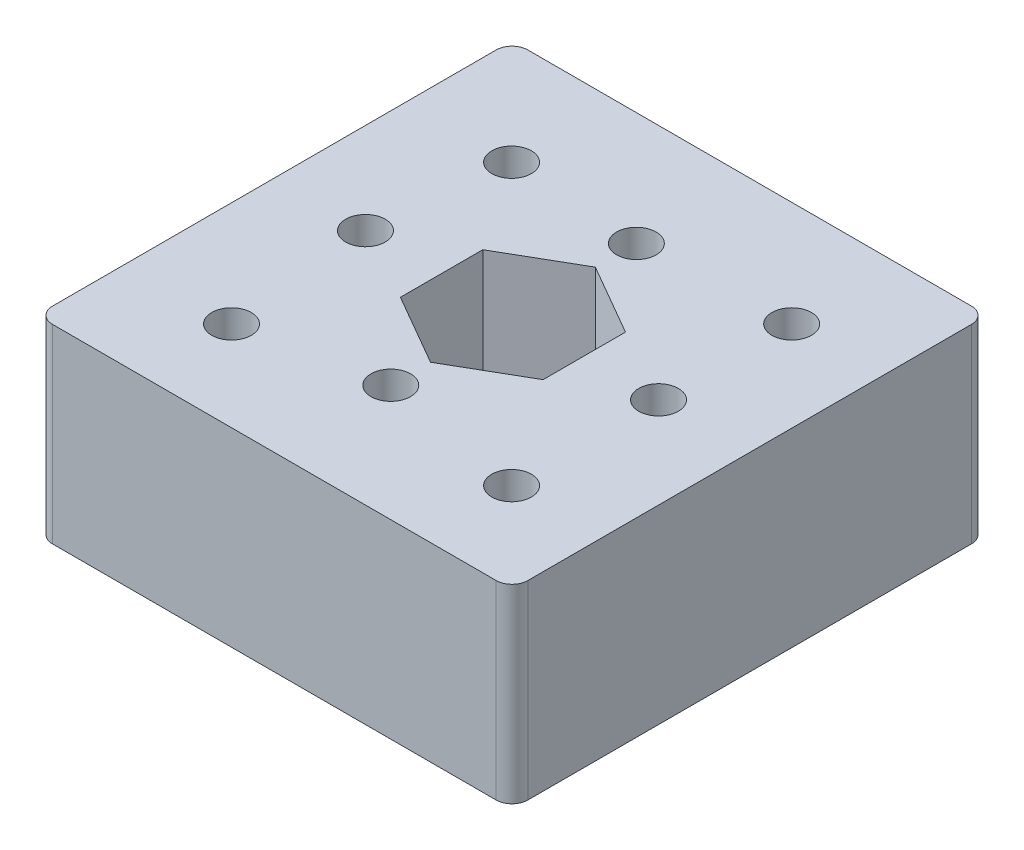
ISO-10303-21;
HEADER;
FILE_DESCRIPTION(('STEP AP214'),'2;1');
FILE_NAME('part.step','',(''),(''),'','','');
FILE_SCHEMA(('AUTOMOTIVE_DESIGN { 1 0 10303 214 1 1 1 1 }'));
ENDSEC;
DATA;
#1=APPLICATION_CONTEXT('core data for automotive mechanical design processes');
#2=APPLICATION_PROTOCOL_DEFINITION('international standard','automotive_design',2000,#1);
#3=PRODUCT_CONTEXT('',#1,'mechanical');
#4=PRODUCT('Part','Part','',(#3));
#5=PRODUCT_RELATED_PRODUCT_CATEGORY('part','',(#4));
#6=PRODUCT_DEFINITION_FORMATION('','',#4);
#7=PRODUCT_DEFINITION_CONTEXT('part definition',#1,'design');
#8=PRODUCT_DEFINITION('design','',#6,#7);
#9=PRODUCT_DEFINITION_SHAPE('','',#8);
#10=(LENGTH_UNIT() NAMED_UNIT(*) SI_UNIT(.MILLI.,.METRE.));
#11=(NAMED_UNIT(*) PLANE_ANGLE_UNIT() SI_UNIT($,.RADIAN.));
#12=(NAMED_UNIT(*) SI_UNIT($,.STERADIAN.) SOLID_ANGLE_UNIT());
#13=UNCERTAINTY_MEASURE_WITH_UNIT(LENGTH_MEASURE(1.E-05),#10,'distance_accuracy_value','');
#14=(GEOMETRIC_REPRESENTATION_CONTEXT(3) GLOBAL_UNCERTAINTY_ASSIGNED_CONTEXT((#13)) GLOBAL_UNIT_ASSIGNED_CONTEXT((#10,
#11,#12)) REPRESENTATION_CONTEXT('',''));
#15=CARTESIAN_POINT('',(0.,0.,0.));
#16=DIRECTION('',(0.,0.,1.));
#17=DIRECTION('',(1.,0.,0.));
#18=AXIS2_PLACEMENT_3D('',#15,#16,#17);
#19=CARTESIAN_POINT('',(0.,12.,0.));
#20=DIRECTION('',(0.,1.,0.));
#21=DIRECTION('',(0.,0.,1.));
#22=AXIS2_PLACEMENT_3D('',#19,#20,#21);
#23=PLANE('',#22);
#24=CARTESIAN_POINT('',(-8.37678757496881,12.,9.32640645963463));
#25=DIRECTION('',(0.,1.,0.));
#26=DIRECTION('',(0.,0.,1.));
#27=AXIS2_PLACEMENT_3D('',#24,#25,#26);
#28=CIRCLE('',#27,1.25);
#29=CARTESIAN_POINT('',(-8.37678757496881,12.,10.5764064596346));
#30=VERTEX_POINT('',#29);
#31=EDGE_CURVE('E651',#30,#30,#28,.T.);
#32=ORIENTED_EDGE('',*,*,#31,.F.);
#33=EDGE_LOOP('',(#32));
#34=FACE_BOUND('',#33,.T.);
#35=CARTESIAN_POINT('',(9.30088195469488,12.,-8.35126307002906));
#36=DIRECTION('',(0.,1.,0.));
#37=DIRECTION('',(0.,0.,1.));
#38=AXIS2_PLACEMENT_3D('',#35,#36,#37);
#39=CIRCLE('',#38,1.25);
#40=CARTESIAN_POINT('',(9.30088195469488,12.,-7.10126307002906));
#41=VERTEX_POINT('',#40);
#42=EDGE_CURVE('E663',#41,#41,#39,.T.);
#43=ORIENTED_EDGE('',*,*,#42,.F.);
#44=EDGE_LOOP('',(#43));
#45=FACE_BOUND('',#44,.T.);
#46=CARTESIAN_POINT('',(0.,12.,-7.84859131854548));
#47=DIRECTION('',(0.,1.,0.));
#48=DIRECTION('',(0.,0.,1.));
#49=AXIS2_PLACEMENT_3D('',#46,#47,#48);
#50=CIRCLE('',#49,1.25);
#51=CARTESIAN_POINT('',(0.,12.,-6.59859131854548));
#52=VERTEX_POINT('',#51);
#53=EDGE_CURVE('E675',#52,#52,#50,.T.);
#54=ORIENTED_EDGE('',*,*,#53,.F.);
#55=EDGE_LOOP('',(#54));
#56=FACE_BOUND('',#55,.T.);
#57=DIRECTION('',(0.,0.,-1.));
#58=VECTOR('',#57,1.);
#59=CARTESIAN_POINT('',(4.50333209967908,12.,2.54076447000943));
#60=LINE('',#59,#58);
#61=CARTESIAN_POINT('',(4.50333209967908,12.,2.54076447000943));
#62=VERTEX_POINT('',#61);
#63=CARTESIAN_POINT('',(4.50333209967908,12.,-2.65923552999057));
#64=VERTEX_POINT('',#63);
#65=EDGE_CURVE('E158',#62,#64,#60,.T.);
#66=ORIENTED_EDGE('',*,*,#65,.F.);
#67=DIRECTION('',(0.866025403784439,0.,-0.5));
#68=VECTOR('',#67,1.);
#69=CARTESIAN_POINT('',(0.,12.,5.14076447000943));
#70=LINE('',#69,#68);
#71=CARTESIAN_POINT('',(0.,12.,5.14076447000943));
#72=VERTEX_POINT('',#71);
#73=EDGE_CURVE('E147',#72,#62,#70,.T.);
#74=ORIENTED_EDGE('',*,*,#73,.F.);
#75=DIRECTION('',(0.866025403784439,0.,0.5));
#76=VECTOR('',#75,1.);
#77=CARTESIAN_POINT('',(-4.50333209967908,12.,2.54076447000943));
#78=LINE('',#77,#76);
#79=CARTESIAN_POINT('',(-4.50333209967908,12.,2.54076447000943));
#80=VERTEX_POINT('',#79);
#81=EDGE_CURVE('E187',#80,#72,#78,.T.);
#82=ORIENTED_EDGE('',*,*,#81,.F.);
#83=DIRECTION('',(0.,0.,1.));
#84=VECTOR('',#83,1.);
#85=CARTESIAN_POINT('',(-4.50333209967908,12.,-2.65923552999057));
#86=LINE('',#85,#84);
#87=CARTESIAN_POINT('',(-4.50333209967908,12.,-2.65923552999057));
#88=VERTEX_POINT('',#87);
#89=EDGE_CURVE('E183',#88,#80,#86,.T.);
#90=ORIENTED_EDGE('',*,*,#89,.F.);
#91=DIRECTION('',(-0.866025403784439,0.,0.5));
#92=VECTOR('',#91,1.);
#93=CARTESIAN_POINT('',(0.,12.,-5.25923552999057));
#94=LINE('',#93,#92);
#95=CARTESIAN_POINT('',(0.,12.,-5.25923552999057));
#96=VERTEX_POINT('',#95);
#97=EDGE_CURVE('E177',#96,#88,#94,.T.);
#98=ORIENTED_EDGE('',*,*,#97,.F.);
#99=DIRECTION('',(-0.866025403784439,0.,-0.5));
#100=VECTOR('',#99,1.);
#101=CARTESIAN_POINT('',(4.50333209967908,12.,-2.65923552999057));
#102=LINE('',#101,#100);
#103=EDGE_CURVE('E173',#64,#96,#102,.T.);
#104=ORIENTED_EDGE('',*,*,#103,.F.);
#105=EDGE_LOOP('',(#66,#74,#82,#90,#98,#104));
#106=FACE_BOUND('',#105,.T.);
#107=CARTESIAN_POINT('',(-9.25,12.,0.));
#108=DIRECTION('',(0.,1.,0.));
#109=DIRECTION('',(0.,0.,1.));
#110=AXIS2_PLACEMENT_3D('',#107,#108,#109);
#111=CIRCLE('',#110,1.25);
#112=CARTESIAN_POINT('',(-9.25,12.,1.25));
#113=VERTEX_POINT('',#112);
#114=EDGE_CURVE('E224',#113,#113,#111,.T.);
#115=ORIENTED_EDGE('',*,*,#114,.F.);
#116=EDGE_LOOP('',(#115));
#117=FACE_BOUND('',#116,.T.);
#118=DIRECTION('',(-1.,0.,0.));
#119=VECTOR('',#118,1.);
#120=CARTESIAN_POINT('',(-15.,12.,-15.));
#121=LINE('',#120,#119);
#122=CARTESIAN_POINT('',(14.,12.,-15.));
#123=VERTEX_POINT('',#122);
#124=CARTESIAN_POINT('',(-14.,12.,-15.));
#125=VERTEX_POINT('',#124);
#126=EDGE_CURVE('E236',#123,#125,#121,.T.);
#127=ORIENTED_EDGE('',*,*,#126,.T.);
#128=CARTESIAN_POINT('',(-14.,12.,-14.));
#129=DIRECTION('',(0.,1.,0.));
#130=DIRECTION('',(0.,0.,1.));
#131=AXIS2_PLACEMENT_3D('',#128,#129,#130);
#132=CIRCLE('',#131,1.);
#133=CARTESIAN_POINT('',(-15.,12.,-14.));
#134=VERTEX_POINT('',#133);
#135=EDGE_CURVE('E294',#125,#134,#132,.T.);
#136=ORIENTED_EDGE('',*,*,#135,.T.);
#137=DIRECTION('',(0.,0.,1.));
#138=VECTOR('',#137,1.);
#139=CARTESIAN_POINT('',(-15.,12.,-15.));
#140=LINE('',#139,#138);
#141=CARTESIAN_POINT('',(-15.,12.,14.));
#142=VERTEX_POINT('',#141);
#143=EDGE_CURVE('E241',#134,#142,#140,.T.);
#144=ORIENTED_EDGE('',*,*,#143,.T.);
#145=CARTESIAN_POINT('',(-14.,12.,14.));
#146=DIRECTION('',(0.,1.,0.));
#147=DIRECTION('',(0.,0.,1.));
#148=AXIS2_PLACEMENT_3D('',#145,#146,#147);
#149=CIRCLE('',#148,1.);
#150=CARTESIAN_POINT('',(-14.,12.,15.));
#151=VERTEX_POINT('',#150);
#152=EDGE_CURVE('E66',#142,#151,#149,.T.);
#153=ORIENTED_EDGE('',*,*,#152,.T.);
#154=DIRECTION('',(1.,0.,0.));
#155=VECTOR('',#154,1.);
#156=CARTESIAN_POINT('',(-15.,12.,15.));
#157=LINE('',#156,#155);
#158=CARTESIAN_POINT('',(14.,12.,15.));
#159=VERTEX_POINT('',#158);
#160=EDGE_CURVE('E244',#151,#159,#157,.T.);
#161=ORIENTED_EDGE('',*,*,#160,.T.);
#162=CARTESIAN_POINT('',(14.,12.,14.));
#163=DIRECTION('',(0.,1.,0.));
#164=DIRECTION('',(0.,0.,1.));
#165=AXIS2_PLACEMENT_3D('',#162,#163,#164);
#166=CIRCLE('',#165,1.);
#167=CARTESIAN_POINT('',(15.,12.,14.));
#168=VERTEX_POINT('',#167);
#169=EDGE_CURVE('E286',#159,#168,#166,.T.);
#170=ORIENTED_EDGE('',*,*,#169,.T.);
#171=DIRECTION('',(0.,0.,-1.));
#172=VECTOR('',#171,1.);
#173=CARTESIAN_POINT('',(15.,12.,-15.));
#174=LINE('',#173,#172);
#175=CARTESIAN_POINT('',(15.,12.,-14.));
#176=VERTEX_POINT('',#175);
#177=EDGE_CURVE('E232',#168,#176,#174,.T.);
#178=ORIENTED_EDGE('',*,*,#177,.T.);
#179=CARTESIAN_POINT('',(14.,12.,-14.));
#180=DIRECTION('',(0.,1.,0.));
#181=DIRECTION('',(0.,0.,1.));
#182=AXIS2_PLACEMENT_3D('',#179,#180,#181);
#183=CIRCLE('',#182,1.);
#184=EDGE_CURVE('E289',#176,#123,#183,.T.);
#185=ORIENTED_EDGE('',*,*,#184,.T.);
#186=EDGE_LOOP('',(#127,#136,#144,#153,#161,#170,#178,#185));
#187=FACE_BOUND('',#186,.T.);
#188=CARTESIAN_POINT('',(9.25,12.,0.));
#189=DIRECTION('',(0.,1.,0.));
#190=DIRECTION('',(0.,0.,1.));
#191=AXIS2_PLACEMENT_3D('',#188,#189,#190);
#192=CIRCLE('',#191,1.25);
#193=CARTESIAN_POINT('',(9.25,12.,1.25));
#194=VERTEX_POINT('',#193);
#195=EDGE_CURVE('E193',#194,#194,#192,.T.);
#196=ORIENTED_EDGE('',*,*,#195,.F.);
#197=EDGE_LOOP('',(#196));
#198=FACE_BOUND('',#197,.T.);
#199=CARTESIAN_POINT('',(0.,12.,7.65140868145452));
#200=DIRECTION('',(0.,1.,0.));
#201=DIRECTION('',(0.,0.,1.));
#202=AXIS2_PLACEMENT_3D('',#199,#200,#201);
#203=CIRCLE('',#202,1.25);
#204=CARTESIAN_POINT('',(0.,12.,8.90140868145452));
#205=VERTEX_POINT('',#204);
#206=EDGE_CURVE('E669',#205,#205,#203,.T.);
#207=ORIENTED_EDGE('',*,*,#206,.F.);
#208=EDGE_LOOP('',(#207));
#209=FACE_BOUND('',#208,.T.);
#210=CARTESIAN_POINT('',(9.30088195469488,12.,9.32640645963463));
#211=DIRECTION('',(0.,1.,0.));
#212=DIRECTION('',(0.,0.,1.));
#213=AXIS2_PLACEMENT_3D('',#210,#211,#212);
#214=CIRCLE('',#213,1.25);
#215=CARTESIAN_POINT('',(9.30088195469488,12.,10.5764064596346));
#216=VERTEX_POINT('',#215);
#217=EDGE_CURVE('E657',#216,#216,#214,.T.);
#218=ORIENTED_EDGE('',*,*,#217,.F.);
#219=EDGE_LOOP('',(#218));
#220=FACE_BOUND('',#219,.T.);
#221=CARTESIAN_POINT('',(-8.37678757496881,12.,-8.35126307002906));
#222=DIRECTION('',(0.,1.,0.));
#223=DIRECTION('',(0.,0.,1.));
#224=AXIS2_PLACEMENT_3D('',#221,#222,#223);
#225=CIRCLE('',#224,1.25);
#226=CARTESIAN_POINT('',(-8.37678757496881,12.,-7.10126307002906));
#227=VERTEX_POINT('',#226);
#228=EDGE_CURVE('E645',#227,#227,#225,.T.);
#229=ORIENTED_EDGE('',*,*,#228,.F.);
#230=EDGE_LOOP('',(#229));
#231=FACE_BOUND('',#230,.T.);
#232=ADVANCED_FACE('F43',(#34,#45,#56,#106,#117,#187,#198,#209,#220,#231),#23,.T.);
#233=CARTESIAN_POINT('',(0.,0.,0.));
#234=DIRECTION('',(0.,1.,0.));
#235=DIRECTION('',(0.,0.,1.));
#236=AXIS2_PLACEMENT_3D('',#233,#234,#235);
#237=PLANE('',#236);
#238=CARTESIAN_POINT('',(-9.25,0.,0.));
#239=DIRECTION('',(0.,1.,0.));
#240=DIRECTION('',(0.,0.,1.));
#241=AXIS2_PLACEMENT_3D('',#238,#239,#240);
#242=CIRCLE('',#241,1.25);
#243=CARTESIAN_POINT('',(-9.25,0.,1.25));
#244=VERTEX_POINT('',#243);
#245=EDGE_CURVE('E167',#244,#244,#242,.T.);
#246=ORIENTED_EDGE('',*,*,#245,.T.);
#247=EDGE_LOOP('',(#246));
#248=FACE_BOUND('',#247,.T.);
#249=DIRECTION('',(0.,0.,1.));
#250=VECTOR('',#249,1.);
#251=CARTESIAN_POINT('',(-15.,0.,-15.));
#252=LINE('',#251,#250);
#253=CARTESIAN_POINT('',(-15.,0.,-14.));
#254=VERTEX_POINT('',#253);
#255=CARTESIAN_POINT('',(-15.,0.,14.));
#256=VERTEX_POINT('',#255);
#257=EDGE_CURVE('E255',#254,#256,#252,.T.);
#258=ORIENTED_EDGE('',*,*,#257,.F.);
#259=CARTESIAN_POINT('',(-14.,0.,-14.));
#260=DIRECTION('',(0.,1.,0.));
#261=DIRECTION('',(0.,0.,1.));
#262=AXIS2_PLACEMENT_3D('',#259,#260,#261);
#263=CIRCLE('',#262,1.);
#264=CARTESIAN_POINT('',(-14.,0.,-15.));
#265=VERTEX_POINT('',#264);
#266=EDGE_CURVE('E276',#254,#265,#263,.F.);
#267=ORIENTED_EDGE('',*,*,#266,.T.);
#268=DIRECTION('',(-1.,0.,0.));
#269=VECTOR('',#268,1.);
#270=CARTESIAN_POINT('',(-15.,0.,-15.));
#271=LINE('',#270,#269);
#272=CARTESIAN_POINT('',(14.,0.,-15.));
#273=VERTEX_POINT('',#272);
#274=EDGE_CURVE('E251',#273,#265,#271,.T.);
#275=ORIENTED_EDGE('',*,*,#274,.F.);
#276=CARTESIAN_POINT('',(14.,0.,-14.));
#277=DIRECTION('',(0.,1.,0.));
#278=DIRECTION('',(0.,0.,1.));
#279=AXIS2_PLACEMENT_3D('',#276,#277,#278);
#280=CIRCLE('',#279,1.);
#281=CARTESIAN_POINT('',(15.,0.,-14.));
#282=VERTEX_POINT('',#281);
#283=EDGE_CURVE('E270',#273,#282,#280,.F.);
#284=ORIENTED_EDGE('',*,*,#283,.T.);
#285=DIRECTION('',(0.,0.,-1.));
#286=VECTOR('',#285,1.);
#287=CARTESIAN_POINT('',(15.,0.,-15.));
#288=LINE('',#287,#286);
#289=CARTESIAN_POINT('',(15.,0.,14.));
#290=VERTEX_POINT('',#289);
#291=EDGE_CURVE('E228',#290,#282,#288,.T.);
#292=ORIENTED_EDGE('',*,*,#291,.F.);
#293=CARTESIAN_POINT('',(14.,0.,14.));
#294=DIRECTION('',(0.,1.,0.));
#295=DIRECTION('',(0.,0.,1.));
#296=AXIS2_PLACEMENT_3D('',#293,#294,#295);
#297=CIRCLE('',#296,1.);
#298=CARTESIAN_POINT('',(14.,0.,15.));
#299=VERTEX_POINT('',#298);
#300=EDGE_CURVE('E267',#290,#299,#297,.F.);
#301=ORIENTED_EDGE('',*,*,#300,.T.);
#302=DIRECTION('',(1.,0.,0.));
#303=VECTOR('',#302,1.);
#304=CARTESIAN_POINT('',(-15.,0.,15.));
#305=LINE('',#304,#303);
#306=CARTESIAN_POINT('',(-14.,0.,15.));
#307=VERTEX_POINT('',#306);
#308=EDGE_CURVE('E237',#307,#299,#305,.T.);
#309=ORIENTED_EDGE('',*,*,#308,.F.);
#310=CARTESIAN_POINT('',(-14.,0.,14.));
#311=DIRECTION('',(0.,1.,0.));
#312=DIRECTION('',(0.,0.,1.));
#313=AXIS2_PLACEMENT_3D('',#310,#311,#312);
#314=CIRCLE('',#313,1.);
#315=EDGE_CURVE('E273',#307,#256,#314,.F.);
#316=ORIENTED_EDGE('',*,*,#315,.T.);
#317=EDGE_LOOP('',(#258,#267,#275,#284,#292,#301,#309,#316));
#318=FACE_BOUND('',#317,.T.);
#319=DIRECTION('',(0.866025403784439,0.,-0.5));
#320=VECTOR('',#319,1.);
#321=CARTESIAN_POINT('',(0.,0.,5.14076447000943));
#322=LINE('',#321,#320);
#323=CARTESIAN_POINT('',(0.,0.,5.14076447000943));
#324=VERTEX_POINT('',#323);
#325=CARTESIAN_POINT('',(4.50333209967908,0.,2.54076447000943));
#326=VERTEX_POINT('',#325);
#327=EDGE_CURVE('E190',#324,#326,#322,.T.);
#328=ORIENTED_EDGE('',*,*,#327,.T.);
#329=DIRECTION('',(0.,0.,-1.));
#330=VECTOR('',#329,1.);
#331=CARTESIAN_POINT('',(4.50333209967908,0.,2.54076447000943));
#332=LINE('',#331,#330);
#333=CARTESIAN_POINT('',(4.50333209967908,0.,-2.65923552999057));
#334=VERTEX_POINT('',#333);
#335=EDGE_CURVE('E165',#326,#334,#332,.T.);
#336=ORIENTED_EDGE('',*,*,#335,.T.);
#337=DIRECTION('',(-0.866025403784439,0.,-0.5));
#338=VECTOR('',#337,1.);
#339=CARTESIAN_POINT('',(4.50333209967908,0.,-2.65923552999057));
#340=LINE('',#339,#338);
#341=CARTESIAN_POINT('',(0.,0.,-5.25923552999057));
#342=VERTEX_POINT('',#341);
#343=EDGE_CURVE('E196',#334,#342,#340,.T.);
#344=ORIENTED_EDGE('',*,*,#343,.T.);
#345=DIRECTION('',(-0.866025403784439,0.,0.5));
#346=VECTOR('',#345,1.);
#347=CARTESIAN_POINT('',(0.,0.,-5.25923552999057));
#348=LINE('',#347,#346);
#349=CARTESIAN_POINT('',(-4.50333209967908,0.,-2.65923552999057));
#350=VERTEX_POINT('',#349);
#351=EDGE_CURVE('E200',#342,#350,#348,.T.);
#352=ORIENTED_EDGE('',*,*,#351,.T.);
#353=DIRECTION('',(0.,0.,1.));
#354=VECTOR('',#353,1.);
#355=CARTESIAN_POINT('',(-4.50333209967908,0.,-2.65923552999057));
#356=LINE('',#355,#354);
#357=CARTESIAN_POINT('',(-4.50333209967908,0.,2.54076447000943));
#358=VERTEX_POINT('',#357);
#359=EDGE_CURVE('E204',#350,#358,#356,.T.);
#360=ORIENTED_EDGE('',*,*,#359,.T.);
#361=DIRECTION('',(0.866025403784439,0.,0.5));
#362=VECTOR('',#361,1.);
#363=CARTESIAN_POINT('',(-4.50333209967908,0.,2.54076447000943));
#364=LINE('',#363,#362);
#365=EDGE_CURVE('E159',#358,#324,#364,.T.);
#366=ORIENTED_EDGE('',*,*,#365,.T.);
#367=EDGE_LOOP('',(#328,#336,#344,#352,#360,#366));
#368=FACE_BOUND('',#367,.T.);
#369=CARTESIAN_POINT('',(9.25,0.,0.));
#370=DIRECTION('',(0.,1.,0.));
#371=DIRECTION('',(0.,0.,1.));
#372=AXIS2_PLACEMENT_3D('',#369,#370,#371);
#373=CIRCLE('',#372,1.25);
#374=CARTESIAN_POINT('',(9.25,0.,1.25));
#375=VERTEX_POINT('',#374);
#376=EDGE_CURVE('E619',#375,#375,#373,.T.);
#377=ORIENTED_EDGE('',*,*,#376,.T.);
#378=EDGE_LOOP('',(#377));
#379=FACE_BOUND('',#378,.T.);
#380=CARTESIAN_POINT('',(0.,0.,-7.84859131854548));
#381=DIRECTION('',(0.,1.,0.));
#382=DIRECTION('',(0.,0.,1.));
#383=AXIS2_PLACEMENT_3D('',#380,#381,#382);
#384=CIRCLE('',#383,1.25);
#385=CARTESIAN_POINT('',(0.,0.,-6.59859131854548));
#386=VERTEX_POINT('',#385);
#387=EDGE_CURVE('E623',#386,#386,#384,.T.);
#388=ORIENTED_EDGE('',*,*,#387,.T.);
#389=EDGE_LOOP('',(#388));
#390=FACE_BOUND('',#389,.T.);
#391=CARTESIAN_POINT('',(0.,0.,7.65140868145452));
#392=DIRECTION('',(0.,1.,0.));
#393=DIRECTION('',(0.,0.,1.));
#394=AXIS2_PLACEMENT_3D('',#391,#392,#393);
#395=CIRCLE('',#394,1.25);
#396=CARTESIAN_POINT('',(0.,0.,8.90140868145452));
#397=VERTEX_POINT('',#396);
#398=EDGE_CURVE('E627',#397,#397,#395,.T.);
#399=ORIENTED_EDGE('',*,*,#398,.T.);
#400=EDGE_LOOP('',(#399));
#401=FACE_BOUND('',#400,.T.);
#402=CARTESIAN_POINT('',(9.30088195469488,0.,-8.35126307002906));
#403=DIRECTION('',(0.,1.,0.));
#404=DIRECTION('',(0.,0.,1.));
#405=AXIS2_PLACEMENT_3D('',#402,#403,#404);
#406=CIRCLE('',#405,1.25);
#407=CARTESIAN_POINT('',(9.30088195469488,0.,-7.10126307002906));
#408=VERTEX_POINT('',#407);
#409=EDGE_CURVE('E631',#408,#408,#406,.T.);
#410=ORIENTED_EDGE('',*,*,#409,.T.);
#411=EDGE_LOOP('',(#410));
#412=FACE_BOUND('',#411,.T.);
#413=CARTESIAN_POINT('',(9.30088195469488,0.,9.32640645963463));
#414=DIRECTION('',(0.,1.,0.));
#415=DIRECTION('',(0.,0.,1.));
#416=AXIS2_PLACEMENT_3D('',#413,#414,#415);
#417=CIRCLE('',#416,1.25);
#418=CARTESIAN_POINT('',(9.30088195469488,0.,10.5764064596346));
#419=VERTEX_POINT('',#418);
#420=EDGE_CURVE('E635',#419,#419,#417,.T.);
#421=ORIENTED_EDGE('',*,*,#420,.T.);
#422=EDGE_LOOP('',(#421));
#423=FACE_BOUND('',#422,.T.);
#424=CARTESIAN_POINT('',(-8.37678757496881,0.,9.32640645963463));
#425=DIRECTION('',(0.,1.,0.));
#426=DIRECTION('',(0.,0.,1.));
#427=AXIS2_PLACEMENT_3D('',#424,#425,#426);
#428=CIRCLE('',#427,1.25);
#429=CARTESIAN_POINT('',(-8.37678757496881,0.,10.5764064596346));
#430=VERTEX_POINT('',#429);
#431=EDGE_CURVE('E639',#430,#430,#428,.T.);
#432=ORIENTED_EDGE('',*,*,#431,.T.);
#433=EDGE_LOOP('',(#432));
#434=FACE_BOUND('',#433,.T.);
#435=CARTESIAN_POINT('',(-8.37678757496881,0.,-8.35126307002906));
#436=DIRECTION('',(0.,1.,0.));
#437=DIRECTION('',(0.,0.,1.));
#438=AXIS2_PLACEMENT_3D('',#435,#436,#437);
#439=CIRCLE('',#438,1.25);
#440=CARTESIAN_POINT('',(-8.37678757496881,0.,-7.10126307002906));
#441=VERTEX_POINT('',#440);
#442=EDGE_CURVE('E642',#441,#441,#439,.T.);
#443=ORIENTED_EDGE('',*,*,#442,.T.);
#444=EDGE_LOOP('',(#443));
#445=FACE_BOUND('',#444,.T.);
#446=ADVANCED_FACE('F314',(#248,#318,#368,#379,#390,#401,#412,#423,#434,#445),#237,.F.);
#447=CARTESIAN_POINT('',(15.,12.,-15.));
#448=DIRECTION('',(-1.,0.,0.));
#449=DIRECTION('',(0.,0.,1.));
#450=AXIS2_PLACEMENT_3D('',#447,#448,#449);
#451=PLANE('',#450);
#452=ORIENTED_EDGE('',*,*,#291,.T.);
#453=DIRECTION('',(0.,-1.,0.));
#454=VECTOR('',#453,1.);
#455=CARTESIAN_POINT('',(15.,12.,-14.));
#456=LINE('',#455,#454);
#457=EDGE_CURVE('E11',#282,#176,#456,.F.);
#458=ORIENTED_EDGE('',*,*,#457,.T.);
#459=ORIENTED_EDGE('',*,*,#177,.F.);
#460=DIRECTION('',(0.,-1.,0.));
#461=VECTOR('',#460,1.);
#462=CARTESIAN_POINT('',(15.,12.,14.));
#463=LINE('',#462,#461);
#464=EDGE_CURVE('E52',#168,#290,#463,.T.);
#465=ORIENTED_EDGE('',*,*,#464,.T.);
#466=EDGE_LOOP('',(#452,#458,#459,#465));
#467=FACE_BOUND('',#466,.T.);
#468=ADVANCED_FACE('F308',(#467),#451,.F.);
#469=CARTESIAN_POINT('',(-15.,12.,-15.));
#470=DIRECTION('',(0.,0.,1.));
#471=DIRECTION('',(1.,0.,0.));
#472=AXIS2_PLACEMENT_3D('',#469,#470,#471);
#473=PLANE('',#472);
#474=ORIENTED_EDGE('',*,*,#274,.T.);
#475=DIRECTION('',(0.,-1.,0.));
#476=VECTOR('',#475,1.);
#477=CARTESIAN_POINT('',(-14.,12.,-15.));
#478=LINE('',#477,#476);
#479=EDGE_CURVE('E283',#265,#125,#478,.F.);
#480=ORIENTED_EDGE('',*,*,#479,.T.);
#481=ORIENTED_EDGE('',*,*,#126,.F.);
#482=DIRECTION('',(0.,-1.,0.));
#483=VECTOR('',#482,1.);
#484=CARTESIAN_POINT('',(14.,12.,-15.));
#485=LINE('',#484,#483);
#486=EDGE_CURVE('E279',#123,#273,#485,.T.);
#487=ORIENTED_EDGE('',*,*,#486,.T.);
#488=EDGE_LOOP('',(#474,#480,#481,#487));
#489=FACE_BOUND('',#488,.T.);
#490=ADVANCED_FACE('F324',(#489),#473,.F.);
#491=CARTESIAN_POINT('',(-15.,12.,-15.));
#492=DIRECTION('',(1.,0.,0.));
#493=DIRECTION('',(0.,0.,-1.));
#494=AXIS2_PLACEMENT_3D('',#491,#492,#493);
#495=PLANE('',#494);
#496=ORIENTED_EDGE('',*,*,#143,.F.);
#497=DIRECTION('',(0.,-1.,0.));
#498=VECTOR('',#497,1.);
#499=CARTESIAN_POINT('',(-15.,12.,-14.));
#500=LINE('',#499,#498);
#501=EDGE_CURVE('E263',#134,#254,#500,.T.);
#502=ORIENTED_EDGE('',*,*,#501,.T.);
#503=ORIENTED_EDGE('',*,*,#257,.T.);
#504=DIRECTION('',(0.,-1.,0.));
#505=VECTOR('',#504,1.);
#506=CARTESIAN_POINT('',(-15.,12.,14.));
#507=LINE('',#506,#505);
#508=EDGE_CURVE('E247',#256,#142,#507,.F.);
#509=ORIENTED_EDGE('',*,*,#508,.T.);
#510=EDGE_LOOP('',(#496,#502,#503,#509));
#511=FACE_BOUND('',#510,.T.);
#512=ADVANCED_FACE('F333',(#511),#495,.F.);
#513=CARTESIAN_POINT('',(-15.,12.,15.));
#514=DIRECTION('',(0.,0.,-1.));
#515=DIRECTION('',(-1.,0.,0.));
#516=AXIS2_PLACEMENT_3D('',#513,#514,#515);
#517=PLANE('',#516);
#518=ORIENTED_EDGE('',*,*,#160,.F.);
#519=DIRECTION('',(0.,-1.,0.));
#520=VECTOR('',#519,1.);
#521=CARTESIAN_POINT('',(-14.,12.,15.));
#522=LINE('',#521,#520);
#523=EDGE_CURVE('E299',#151,#307,#522,.T.);
#524=ORIENTED_EDGE('',*,*,#523,.T.);
#525=ORIENTED_EDGE('',*,*,#308,.T.);
#526=DIRECTION('',(0.,-1.,0.));
#527=VECTOR('',#526,1.);
#528=CARTESIAN_POINT('',(14.,12.,15.));
#529=LINE('',#528,#527);
#530=EDGE_CURVE('E59',#299,#159,#529,.F.);
#531=ORIENTED_EDGE('',*,*,#530,.T.);
#532=EDGE_LOOP('',(#518,#524,#525,#531));
#533=FACE_BOUND('',#532,.T.);
#534=ADVANCED_FACE('F338',(#533),#517,.F.);
#535=CARTESIAN_POINT('',(-9.25,12.,0.));
#536=DIRECTION('',(0.,-1.,0.));
#537=DIRECTION('',(0.,0.,-1.));
#538=AXIS2_PLACEMENT_3D('',#535,#536,#537);
#539=CYLINDRICAL_SURFACE('',#538,1.25);
#540=ORIENTED_EDGE('',*,*,#114,.T.);
#541=EDGE_LOOP('',(#540));
#542=FACE_BOUND('',#541,.T.);
#543=ORIENTED_EDGE('',*,*,#245,.F.);
#544=EDGE_LOOP('',(#543));
#545=FACE_BOUND('',#544,.T.);
#546=ADVANCED_FACE('F354',(#542,#545),#539,.F.);
#547=CARTESIAN_POINT('',(0.,12.,5.14076447000943));
#548=DIRECTION('',(-0.5,0.,-0.866025403784438));
#549=DIRECTION('',(-0.866025403784439,0.,0.5));
#550=AXIS2_PLACEMENT_3D('',#547,#548,#549);
#551=PLANE('',#550);
#552=ORIENTED_EDGE('',*,*,#327,.F.);
#553=DIRECTION('',(0.,-1.,0.));
#554=VECTOR('',#553,1.);
#555=CARTESIAN_POINT('',(0.,12.,5.14076447000943));
#556=LINE('',#555,#554);
#557=EDGE_CURVE('E153',#72,#324,#556,.T.);
#558=ORIENTED_EDGE('',*,*,#557,.F.);
#559=ORIENTED_EDGE('',*,*,#73,.T.);
#560=DIRECTION('',(0.,-1.,0.));
#561=VECTOR('',#560,1.);
#562=CARTESIAN_POINT('',(4.50333209967908,12.,2.54076447000943));
#563=LINE('',#562,#561);
#564=EDGE_CURVE('E150',#62,#326,#563,.T.);
#565=ORIENTED_EDGE('',*,*,#564,.T.);
#566=EDGE_LOOP('',(#552,#558,#559,#565));
#567=FACE_BOUND('',#566,.T.);
#568=ADVANCED_FACE('F149',(#567),#551,.T.);
#569=CARTESIAN_POINT('',(4.50333209967908,12.,2.54076447000943));
#570=DIRECTION('',(-1.,0.,0.));
#571=DIRECTION('',(0.,0.,1.));
#572=AXIS2_PLACEMENT_3D('',#569,#570,#571);
#573=PLANE('',#572);
#574=ORIENTED_EDGE('',*,*,#335,.F.);
#575=ORIENTED_EDGE('',*,*,#564,.F.);
#576=ORIENTED_EDGE('',*,*,#65,.T.);
#577=DIRECTION('',(0.,-1.,0.));
#578=VECTOR('',#577,1.);
#579=CARTESIAN_POINT('',(4.50333209967908,12.,-2.65923552999057));
#580=LINE('',#579,#578);
#581=EDGE_CURVE('E168',#64,#334,#580,.T.);
#582=ORIENTED_EDGE('',*,*,#581,.T.);
#583=EDGE_LOOP('',(#574,#575,#576,#582));
#584=FACE_BOUND('',#583,.T.);
#585=ADVANCED_FACE('F162',(#584),#573,.T.);
#586=CARTESIAN_POINT('',(4.50333209967908,12.,-2.65923552999057));
#587=DIRECTION('',(-0.5,0.,0.866025403784439));
#588=DIRECTION('',(0.866025403784439,0.,0.5));
#589=AXIS2_PLACEMENT_3D('',#586,#587,#588);
#590=PLANE('',#589);
#591=ORIENTED_EDGE('',*,*,#343,.F.);
#592=ORIENTED_EDGE('',*,*,#581,.F.);
#593=ORIENTED_EDGE('',*,*,#103,.T.);
#594=DIRECTION('',(0.,-1.,0.));
#595=VECTOR('',#594,1.);
#596=CARTESIAN_POINT('',(0.,12.,-5.25923552999057));
#597=LINE('',#596,#595);
#598=EDGE_CURVE('E219',#96,#342,#597,.T.);
#599=ORIENTED_EDGE('',*,*,#598,.T.);
#600=EDGE_LOOP('',(#591,#592,#593,#599));
#601=FACE_BOUND('',#600,.T.);
#602=ADVANCED_FACE('F493',(#601),#590,.T.);
#603=CARTESIAN_POINT('',(0.,12.,-5.25923552999057));
#604=DIRECTION('',(0.5,0.,0.866025403784439));
#605=DIRECTION('',(0.866025403784439,0.,-0.5));
#606=AXIS2_PLACEMENT_3D('',#603,#604,#605);
#607=PLANE('',#606);
#608=ORIENTED_EDGE('',*,*,#351,.F.);
#609=ORIENTED_EDGE('',*,*,#598,.F.);
#610=ORIENTED_EDGE('',*,*,#97,.T.);
#611=DIRECTION('',(0.,-1.,0.));
#612=VECTOR('',#611,1.);
#613=CARTESIAN_POINT('',(-4.50333209967908,12.,-2.65923552999057));
#614=LINE('',#613,#612);
#615=EDGE_CURVE('E216',#88,#350,#614,.T.);
#616=ORIENTED_EDGE('',*,*,#615,.T.);
#617=EDGE_LOOP('',(#608,#609,#610,#616));
#618=FACE_BOUND('',#617,.T.);
#619=ADVANCED_FACE('F483',(#618),#607,.T.);
#620=CARTESIAN_POINT('',(-4.50333209967908,12.,-2.65923552999057));
#621=DIRECTION('',(1.,0.,0.));
#622=DIRECTION('',(0.,0.,-1.));
#623=AXIS2_PLACEMENT_3D('',#620,#621,#622);
#624=PLANE('',#623);
#625=ORIENTED_EDGE('',*,*,#359,.F.);
#626=ORIENTED_EDGE('',*,*,#615,.F.);
#627=ORIENTED_EDGE('',*,*,#89,.T.);
#628=DIRECTION('',(0.,-1.,0.));
#629=VECTOR('',#628,1.);
#630=CARTESIAN_POINT('',(-4.50333209967908,12.,2.54076447000943));
#631=LINE('',#630,#629);
#632=EDGE_CURVE('E213',#80,#358,#631,.T.);
#633=ORIENTED_EDGE('',*,*,#632,.T.);
#634=EDGE_LOOP('',(#625,#626,#627,#633));
#635=FACE_BOUND('',#634,.T.);
#636=ADVANCED_FACE('F473',(#635),#624,.T.);
#637=CARTESIAN_POINT('',(-4.50333209967908,12.,2.54076447000943));
#638=DIRECTION('',(0.5,0.,-0.866025403784438));
#639=DIRECTION('',(-0.866025403784439,0.,-0.5));
#640=AXIS2_PLACEMENT_3D('',#637,#638,#639);
#641=PLANE('',#640);
#642=ORIENTED_EDGE('',*,*,#365,.F.);
#643=ORIENTED_EDGE('',*,*,#632,.F.);
#644=ORIENTED_EDGE('',*,*,#81,.T.);
#645=ORIENTED_EDGE('',*,*,#557,.T.);
#646=EDGE_LOOP('',(#642,#643,#644,#645));
#647=FACE_BOUND('',#646,.T.);
#648=ADVANCED_FACE('F463',(#647),#641,.T.);
#649=CARTESIAN_POINT('',(9.25,12.,0.));
#650=DIRECTION('',(0.,-1.,0.));
#651=DIRECTION('',(0.,0.,-1.));
#652=AXIS2_PLACEMENT_3D('',#649,#650,#651);
#653=CYLINDRICAL_SURFACE('',#652,1.25);
#654=ORIENTED_EDGE('',*,*,#195,.T.);
#655=EDGE_LOOP('',(#654));
#656=FACE_BOUND('',#655,.T.);
#657=ORIENTED_EDGE('',*,*,#376,.F.);
#658=EDGE_LOOP('',(#657));
#659=FACE_BOUND('',#658,.T.);
#660=ADVANCED_FACE('F453',(#656,#659),#653,.F.);
#661=CARTESIAN_POINT('',(0.,12.,-7.84859131854548));
#662=DIRECTION('',(0.,-1.,0.));
#663=DIRECTION('',(0.,0.,-1.));
#664=AXIS2_PLACEMENT_3D('',#661,#662,#663);
#665=CYLINDRICAL_SURFACE('',#664,1.25);
#666=ORIENTED_EDGE('',*,*,#53,.T.);
#667=EDGE_LOOP('',(#666));
#668=FACE_BOUND('',#667,.T.);
#669=ORIENTED_EDGE('',*,*,#387,.F.);
#670=EDGE_LOOP('',(#669));
#671=FACE_BOUND('',#670,.T.);
#672=ADVANCED_FACE('F443',(#668,#671),#665,.F.);
#673=CARTESIAN_POINT('',(0.,12.,7.65140868145452));
#674=DIRECTION('',(0.,-1.,0.));
#675=DIRECTION('',(0.,0.,-1.));
#676=AXIS2_PLACEMENT_3D('',#673,#674,#675);
#677=CYLINDRICAL_SURFACE('',#676,1.25);
#678=ORIENTED_EDGE('',*,*,#206,.T.);
#679=EDGE_LOOP('',(#678));
#680=FACE_BOUND('',#679,.T.);
#681=ORIENTED_EDGE('',*,*,#398,.F.);
#682=EDGE_LOOP('',(#681));
#683=FACE_BOUND('',#682,.T.);
#684=ADVANCED_FACE('F433',(#680,#683),#677,.F.);
#685=CARTESIAN_POINT('',(9.30088195469488,12.,-8.35126307002906));
#686=DIRECTION('',(0.,-1.,0.));
#687=DIRECTION('',(0.,0.,-1.));
#688=AXIS2_PLACEMENT_3D('',#685,#686,#687);
#689=CYLINDRICAL_SURFACE('',#688,1.25);
#690=ORIENTED_EDGE('',*,*,#42,.T.);
#691=EDGE_LOOP('',(#690));
#692=FACE_BOUND('',#691,.T.);
#693=ORIENTED_EDGE('',*,*,#409,.F.);
#694=EDGE_LOOP('',(#693));
#695=FACE_BOUND('',#694,.T.);
#696=ADVANCED_FACE('F423',(#692,#695),#689,.F.);
#697=CARTESIAN_POINT('',(9.30088195469488,12.,9.32640645963463));
#698=DIRECTION('',(0.,-1.,0.));
#699=DIRECTION('',(0.,0.,-1.));
#700=AXIS2_PLACEMENT_3D('',#697,#698,#699);
#701=CYLINDRICAL_SURFACE('',#700,1.25);
#702=ORIENTED_EDGE('',*,*,#217,.T.);
#703=EDGE_LOOP('',(#702));
#704=FACE_BOUND('',#703,.T.);
#705=ORIENTED_EDGE('',*,*,#420,.F.);
#706=EDGE_LOOP('',(#705));
#707=FACE_BOUND('',#706,.T.);
#708=ADVANCED_FACE('F413',(#704,#707),#701,.F.);
#709=CARTESIAN_POINT('',(-8.37678757496881,12.,9.32640645963463));
#710=DIRECTION('',(0.,-1.,0.));
#711=DIRECTION('',(0.,0.,-1.));
#712=AXIS2_PLACEMENT_3D('',#709,#710,#711);
#713=CYLINDRICAL_SURFACE('',#712,1.25);
#714=ORIENTED_EDGE('',*,*,#31,.T.);
#715=EDGE_LOOP('',(#714));
#716=FACE_BOUND('',#715,.T.);
#717=ORIENTED_EDGE('',*,*,#431,.F.);
#718=EDGE_LOOP('',(#717));
#719=FACE_BOUND('',#718,.T.);
#720=ADVANCED_FACE('F403',(#716,#719),#713,.F.);
#721=CARTESIAN_POINT('',(-8.37678757496881,12.,-8.35126307002906));
#722=DIRECTION('',(0.,-1.,0.));
#723=DIRECTION('',(0.,0.,-1.));
#724=AXIS2_PLACEMENT_3D('',#721,#722,#723);
#725=CYLINDRICAL_SURFACE('',#724,1.25);
#726=ORIENTED_EDGE('',*,*,#228,.T.);
#727=EDGE_LOOP('',(#726));
#728=FACE_BOUND('',#727,.T.);
#729=ORIENTED_EDGE('',*,*,#442,.F.);
#730=EDGE_LOOP('',(#729));
#731=FACE_BOUND('',#730,.T.);
#732=ADVANCED_FACE('F367',(#728,#731),#725,.F.);
#733=CARTESIAN_POINT('',(-14.,12.,-14.));
#734=DIRECTION('',(0.,-1.,0.));
#735=DIRECTION('',(0.,0.,-1.));
#736=AXIS2_PLACEMENT_3D('',#733,#734,#735);
#737=CYLINDRICAL_SURFACE('',#736,1.);
#738=ORIENTED_EDGE('',*,*,#135,.F.);
#739=ORIENTED_EDGE('',*,*,#479,.F.);
#740=ORIENTED_EDGE('',*,*,#266,.F.);
#741=ORIENTED_EDGE('',*,*,#501,.F.);
#742=EDGE_LOOP('',(#738,#739,#740,#741));
#743=FACE_BOUND('',#742,.T.);
#744=ADVANCED_FACE('F331',(#743),#737,.T.);
#745=CARTESIAN_POINT('',(-14.,12.,14.));
#746=DIRECTION('',(0.,-1.,0.));
#747=DIRECTION('',(0.,0.,-1.));
#748=AXIS2_PLACEMENT_3D('',#745,#746,#747);
#749=CYLINDRICAL_SURFACE('',#748,1.);
#750=ORIENTED_EDGE('',*,*,#152,.F.);
#751=ORIENTED_EDGE('',*,*,#508,.F.);
#752=ORIENTED_EDGE('',*,*,#315,.F.);
#753=ORIENTED_EDGE('',*,*,#523,.F.);
#754=EDGE_LOOP('',(#750,#751,#752,#753));
#755=FACE_BOUND('',#754,.T.);
#756=ADVANCED_FACE('F337',(#755),#749,.T.);
#757=CARTESIAN_POINT('',(14.,12.,-14.));
#758=DIRECTION('',(0.,-1.,0.));
#759=DIRECTION('',(0.,0.,-1.));
#760=AXIS2_PLACEMENT_3D('',#757,#758,#759);
#761=CYLINDRICAL_SURFACE('',#760,1.);
#762=ORIENTED_EDGE('',*,*,#184,.F.);
#763=ORIENTED_EDGE('',*,*,#457,.F.);
#764=ORIENTED_EDGE('',*,*,#283,.F.);
#765=ORIENTED_EDGE('',*,*,#486,.F.);
#766=EDGE_LOOP('',(#762,#763,#764,#765));
#767=FACE_BOUND('',#766,.T.);
#768=ADVANCED_FACE('F321',(#767),#761,.T.);
#769=CARTESIAN_POINT('',(14.,12.,14.));
#770=DIRECTION('',(0.,-1.,0.));
#771=DIRECTION('',(0.,0.,-1.));
#772=AXIS2_PLACEMENT_3D('',#769,#770,#771);
#773=CYLINDRICAL_SURFACE('',#772,1.);
#774=ORIENTED_EDGE('',*,*,#169,.F.);
#775=ORIENTED_EDGE('',*,*,#530,.F.);
#776=ORIENTED_EDGE('',*,*,#300,.F.);
#777=ORIENTED_EDGE('',*,*,#464,.F.);
#778=EDGE_LOOP('',(#774,#775,#776,#777));
#779=FACE_BOUND('',#778,.T.);
#780=ADVANCED_FACE('F45',(#779),#773,.T.);
#781=CLOSED_SHELL('',(#232,#446,#468,#490,#512,#534,#546,#568,#585,#602,#619,#636,#648,#660,
#672,#684,#696,#708,#720,#732,#744,#756,#768,#780));
#782=MANIFOLD_SOLID_BREP('B2',#781);
#783=ADVANCED_BREP_SHAPE_REPRESENTATION('',(#18,#782),#14);
#784=SHAPE_DEFINITION_REPRESENTATION(#9,#783);
ENDSEC;
END-ISO-10303-21;
